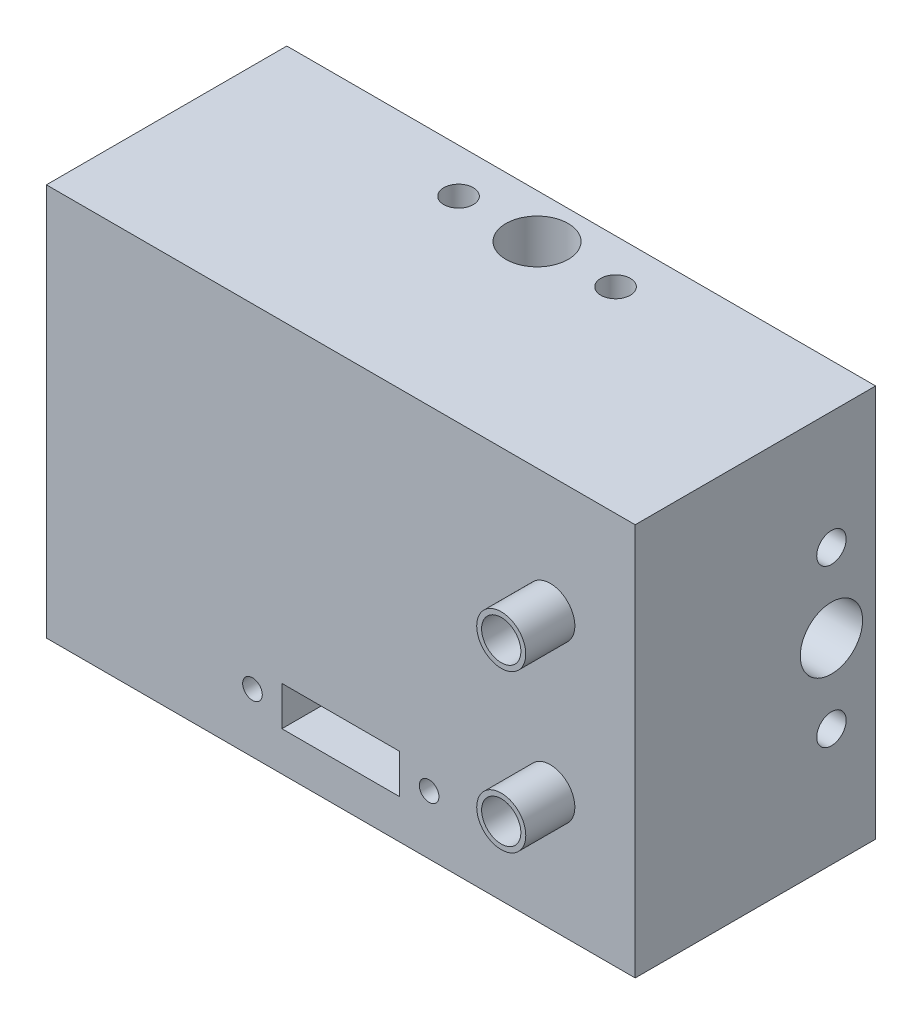
ISO-10303-21;
HEADER;
FILE_DESCRIPTION(('STEP AP214'),'2;1');
FILE_NAME('part.step','',(''),(''),'','','');
FILE_SCHEMA(('AUTOMOTIVE_DESIGN { 1 0 10303 214 1 1 1 1 }'));
ENDSEC;
DATA;
#1=APPLICATION_CONTEXT('core data for automotive mechanical design processes');
#2=APPLICATION_PROTOCOL_DEFINITION('international standard','automotive_design',2000,#1);
#3=PRODUCT_CONTEXT('',#1,'mechanical');
#4=PRODUCT('Part','Part','',(#3));
#5=PRODUCT_RELATED_PRODUCT_CATEGORY('part','',(#4));
#6=PRODUCT_DEFINITION_FORMATION('','',#4);
#7=PRODUCT_DEFINITION_CONTEXT('part definition',#1,'design');
#8=PRODUCT_DEFINITION('design','',#6,#7);
#9=PRODUCT_DEFINITION_SHAPE('','',#8);
#10=(LENGTH_UNIT() NAMED_UNIT(*) SI_UNIT(.MILLI.,.METRE.));
#11=(NAMED_UNIT(*) PLANE_ANGLE_UNIT() SI_UNIT($,.RADIAN.));
#12=(NAMED_UNIT(*) SI_UNIT($,.STERADIAN.) SOLID_ANGLE_UNIT());
#13=UNCERTAINTY_MEASURE_WITH_UNIT(LENGTH_MEASURE(1.E-05),#10,'distance_accuracy_value','');
#14=(GEOMETRIC_REPRESENTATION_CONTEXT(3) GLOBAL_UNCERTAINTY_ASSIGNED_CONTEXT((#13)) GLOBAL_UNIT_ASSIGNED_CONTEXT((#10,
#11,#12)) REPRESENTATION_CONTEXT('',''));
#15=CARTESIAN_POINT('',(0.,0.,0.));
#16=DIRECTION('',(0.,0.,1.));
#17=DIRECTION('',(1.,0.,0.));
#18=AXIS2_PLACEMENT_3D('',#15,#16,#17);
#19=CARTESIAN_POINT('',(0.,0.,24.5));
#20=DIRECTION('',(1.,0.,0.));
#21=DIRECTION('',(0.,0.,-1.));
#22=AXIS2_PLACEMENT_3D('',#19,#20,#21);
#23=PLANE('',#22);
#24=CARTESIAN_POINT('',(0.,12.,4.5));
#25=DIRECTION('',(-1.,0.,0.));
#26=DIRECTION('',(0.,0.,-1.));
#27=AXIS2_PLACEMENT_3D('',#24,#25,#26);
#28=CIRCLE('',#27,1.5);
#29=CARTESIAN_POINT('',(0.,12.,3.));
#30=VERTEX_POINT('',#29);
#31=EDGE_CURVE('E201',#30,#30,#28,.T.);
#32=ORIENTED_EDGE('',*,*,#31,.F.);
#33=EDGE_LOOP('',(#32));
#34=FACE_BOUND('',#33,.T.);
#35=CARTESIAN_POINT('',(0.,28.,4.5));
#36=DIRECTION('',(-1.,0.,0.));
#37=DIRECTION('',(0.,0.,1.));
#38=AXIS2_PLACEMENT_3D('',#35,#36,#37);
#39=CIRCLE('',#38,1.5);
#40=CARTESIAN_POINT('',(0.,28.,6.));
#41=VERTEX_POINT('',#40);
#42=EDGE_CURVE('E208',#41,#41,#39,.T.);
#43=ORIENTED_EDGE('',*,*,#42,.F.);
#44=EDGE_LOOP('',(#43));
#45=FACE_BOUND('',#44,.T.);
#46=CARTESIAN_POINT('',(0.,20.,4.5));
#47=DIRECTION('',(-1.,0.,0.));
#48=DIRECTION('',(0.,0.,1.));
#49=AXIS2_PLACEMENT_3D('',#46,#47,#48);
#50=CIRCLE('',#49,3.175);
#51=CARTESIAN_POINT('',(0.,20.,7.675));
#52=VERTEX_POINT('',#51);
#53=EDGE_CURVE('E207',#52,#52,#50,.T.);
#54=ORIENTED_EDGE('',*,*,#53,.F.);
#55=EDGE_LOOP('',(#54));
#56=FACE_BOUND('',#55,.T.);
#57=DIRECTION('',(0.,-1.,0.));
#58=VECTOR('',#57,1.);
#59=CARTESIAN_POINT('',(0.,0.,0.));
#60=LINE('',#59,#58);
#61=CARTESIAN_POINT('',(0.,40.,0.));
#62=VERTEX_POINT('',#61);
#63=CARTESIAN_POINT('',(0.,0.,0.));
#64=VERTEX_POINT('',#63);
#65=EDGE_CURVE('E228',#62,#64,#60,.T.);
#66=ORIENTED_EDGE('',*,*,#65,.T.);
#67=DIRECTION('',(0.,0.,-1.));
#68=VECTOR('',#67,1.);
#69=CARTESIAN_POINT('',(0.,0.,24.5));
#70=LINE('',#69,#68);
#71=CARTESIAN_POINT('',(0.,0.,24.5));
#72=VERTEX_POINT('',#71);
#73=EDGE_CURVE('E251',#72,#64,#70,.T.);
#74=ORIENTED_EDGE('',*,*,#73,.F.);
#75=DIRECTION('',(0.,-1.,0.));
#76=VECTOR('',#75,1.);
#77=CARTESIAN_POINT('',(0.,0.,24.5));
#78=LINE('',#77,#76);
#79=CARTESIAN_POINT('',(0.,40.,24.5));
#80=VERTEX_POINT('',#79);
#81=EDGE_CURVE('E231',#80,#72,#78,.T.);
#82=ORIENTED_EDGE('',*,*,#81,.F.);
#83=DIRECTION('',(0.,0.,-1.));
#84=VECTOR('',#83,1.);
#85=CARTESIAN_POINT('',(0.,40.,24.5));
#86=LINE('',#85,#84);
#87=EDGE_CURVE('E237',#80,#62,#86,.T.);
#88=ORIENTED_EDGE('',*,*,#87,.T.);
#89=EDGE_LOOP('',(#66,#74,#82,#88));
#90=FACE_BOUND('',#89,.T.);
#91=ADVANCED_FACE('F33',(#34,#45,#56,#90),#23,.F.);
#92=CARTESIAN_POINT('',(0.,0.,24.5));
#93=DIRECTION('',(0.,1.,0.));
#94=DIRECTION('',(0.,0.,1.));
#95=AXIS2_PLACEMENT_3D('',#92,#93,#94);
#96=PLANE('',#95);
#97=CARTESIAN_POINT('',(22.,0.,4.5));
#98=DIRECTION('',(0.,1.,0.));
#99=DIRECTION('',(0.,0.,-1.));
#100=AXIS2_PLACEMENT_3D('',#97,#98,#99);
#101=CIRCLE('',#100,1.5);
#102=CARTESIAN_POINT('',(22.,0.,3.));
#103=VERTEX_POINT('',#102);
#104=EDGE_CURVE('E146',#103,#103,#101,.T.);
#105=ORIENTED_EDGE('',*,*,#104,.T.);
#106=EDGE_LOOP('',(#105));
#107=FACE_BOUND('',#106,.T.);
#108=CARTESIAN_POINT('',(38.,0.,4.5));
#109=DIRECTION('',(0.,1.,0.));
#110=DIRECTION('',(0.,0.,1.));
#111=AXIS2_PLACEMENT_3D('',#108,#109,#110);
#112=CIRCLE('',#111,1.5);
#113=CARTESIAN_POINT('',(38.,0.,6.));
#114=VERTEX_POINT('',#113);
#115=EDGE_CURVE('E154',#114,#114,#112,.T.);
#116=ORIENTED_EDGE('',*,*,#115,.T.);
#117=EDGE_LOOP('',(#116));
#118=FACE_BOUND('',#117,.T.);
#119=CARTESIAN_POINT('',(30.,0.,4.5));
#120=DIRECTION('',(0.,1.,0.));
#121=DIRECTION('',(0.,0.,1.));
#122=AXIS2_PLACEMENT_3D('',#119,#120,#121);
#123=CIRCLE('',#122,3.175);
#124=CARTESIAN_POINT('',(30.,0.,7.675));
#125=VERTEX_POINT('',#124);
#126=EDGE_CURVE('E153',#125,#125,#123,.T.);
#127=ORIENTED_EDGE('',*,*,#126,.T.);
#128=EDGE_LOOP('',(#127));
#129=FACE_BOUND('',#128,.T.);
#130=DIRECTION('',(1.,0.,0.));
#131=VECTOR('',#130,1.);
#132=CARTESIAN_POINT('',(0.,0.,0.));
#133=LINE('',#132,#131);
#134=CARTESIAN_POINT('',(60.,0.,0.));
#135=VERTEX_POINT('',#134);
#136=EDGE_CURVE('E240',#64,#135,#133,.T.);
#137=ORIENTED_EDGE('',*,*,#136,.T.);
#138=DIRECTION('',(0.,0.,-1.));
#139=VECTOR('',#138,1.);
#140=CARTESIAN_POINT('',(60.,0.,24.5));
#141=LINE('',#140,#139);
#142=CARTESIAN_POINT('',(60.,0.,24.5));
#143=VERTEX_POINT('',#142);
#144=EDGE_CURVE('E248',#143,#135,#141,.T.);
#145=ORIENTED_EDGE('',*,*,#144,.F.);
#146=DIRECTION('',(1.,0.,0.));
#147=VECTOR('',#146,1.);
#148=CARTESIAN_POINT('',(0.,0.,24.5));
#149=LINE('',#148,#147);
#150=EDGE_CURVE('E85',#72,#143,#149,.T.);
#151=ORIENTED_EDGE('',*,*,#150,.F.);
#152=ORIENTED_EDGE('',*,*,#73,.T.);
#153=EDGE_LOOP('',(#137,#145,#151,#152));
#154=FACE_BOUND('',#153,.T.);
#155=ADVANCED_FACE('F281',(#107,#118,#129,#154),#96,.F.);
#156=CARTESIAN_POINT('',(60.,0.,24.5));
#157=DIRECTION('',(-1.,0.,0.));
#158=DIRECTION('',(0.,0.,1.));
#159=AXIS2_PLACEMENT_3D('',#156,#157,#158);
#160=PLANE('',#159);
#161=CARTESIAN_POINT('',(60.,12.,4.5));
#162=DIRECTION('',(-1.,0.,0.));
#163=DIRECTION('',(0.,0.,-1.));
#164=AXIS2_PLACEMENT_3D('',#161,#162,#163);
#165=CIRCLE('',#164,1.5);
#166=CARTESIAN_POINT('',(60.,12.,3.));
#167=VERTEX_POINT('',#166);
#168=EDGE_CURVE('E183',#167,#167,#165,.T.);
#169=ORIENTED_EDGE('',*,*,#168,.T.);
#170=EDGE_LOOP('',(#169));
#171=FACE_BOUND('',#170,.T.);
#172=CARTESIAN_POINT('',(60.,28.,4.5));
#173=DIRECTION('',(-1.,0.,0.));
#174=DIRECTION('',(0.,0.,1.));
#175=AXIS2_PLACEMENT_3D('',#172,#173,#174);
#176=CIRCLE('',#175,1.5);
#177=CARTESIAN_POINT('',(60.,28.,6.));
#178=VERTEX_POINT('',#177);
#179=EDGE_CURVE('E190',#178,#178,#176,.T.);
#180=ORIENTED_EDGE('',*,*,#179,.T.);
#181=EDGE_LOOP('',(#180));
#182=FACE_BOUND('',#181,.T.);
#183=CARTESIAN_POINT('',(60.,20.,4.5));
#184=DIRECTION('',(-1.,0.,0.));
#185=DIRECTION('',(0.,0.,1.));
#186=AXIS2_PLACEMENT_3D('',#183,#184,#185);
#187=CIRCLE('',#186,3.175);
#188=CARTESIAN_POINT('',(60.,20.,7.675));
#189=VERTEX_POINT('',#188);
#190=EDGE_CURVE('E189',#189,#189,#187,.T.);
#191=ORIENTED_EDGE('',*,*,#190,.T.);
#192=EDGE_LOOP('',(#191));
#193=FACE_BOUND('',#192,.T.);
#194=DIRECTION('',(0.,1.,0.));
#195=VECTOR('',#194,1.);
#196=CARTESIAN_POINT('',(60.,0.,0.));
#197=LINE('',#196,#195);
#198=CARTESIAN_POINT('',(60.,40.,0.));
#199=VERTEX_POINT('',#198);
#200=EDGE_CURVE('E242',#135,#199,#197,.T.);
#201=ORIENTED_EDGE('',*,*,#200,.T.);
#202=DIRECTION('',(0.,0.,-1.));
#203=VECTOR('',#202,1.);
#204=CARTESIAN_POINT('',(60.,40.,24.5));
#205=LINE('',#204,#203);
#206=CARTESIAN_POINT('',(60.,40.,24.5));
#207=VERTEX_POINT('',#206);
#208=EDGE_CURVE('E246',#207,#199,#205,.T.);
#209=ORIENTED_EDGE('',*,*,#208,.F.);
#210=DIRECTION('',(0.,1.,0.));
#211=VECTOR('',#210,1.);
#212=CARTESIAN_POINT('',(60.,0.,24.5));
#213=LINE('',#212,#211);
#214=EDGE_CURVE('E234',#143,#207,#213,.T.);
#215=ORIENTED_EDGE('',*,*,#214,.F.);
#216=ORIENTED_EDGE('',*,*,#144,.T.);
#217=EDGE_LOOP('',(#201,#209,#215,#216));
#218=FACE_BOUND('',#217,.T.);
#219=ADVANCED_FACE('F286',(#171,#182,#193,#218),#160,.F.);
#220=CARTESIAN_POINT('',(0.,40.,24.5));
#221=DIRECTION('',(0.,-1.,0.));
#222=DIRECTION('',(0.,0.,-1.));
#223=AXIS2_PLACEMENT_3D('',#220,#221,#222);
#224=PLANE('',#223);
#225=CARTESIAN_POINT('',(22.,40.,4.5));
#226=DIRECTION('',(0.,1.,0.));
#227=DIRECTION('',(0.,0.,-1.));
#228=AXIS2_PLACEMENT_3D('',#225,#226,#227);
#229=CIRCLE('',#228,1.5);
#230=CARTESIAN_POINT('',(22.,40.,3.));
#231=VERTEX_POINT('',#230);
#232=EDGE_CURVE('E165',#231,#231,#229,.T.);
#233=ORIENTED_EDGE('',*,*,#232,.F.);
#234=EDGE_LOOP('',(#233));
#235=FACE_BOUND('',#234,.T.);
#236=CARTESIAN_POINT('',(38.,40.,4.5));
#237=DIRECTION('',(0.,1.,0.));
#238=DIRECTION('',(0.,0.,1.));
#239=AXIS2_PLACEMENT_3D('',#236,#237,#238);
#240=CIRCLE('',#239,1.5);
#241=CARTESIAN_POINT('',(38.,40.,6.));
#242=VERTEX_POINT('',#241);
#243=EDGE_CURVE('E172',#242,#242,#240,.T.);
#244=ORIENTED_EDGE('',*,*,#243,.F.);
#245=EDGE_LOOP('',(#244));
#246=FACE_BOUND('',#245,.T.);
#247=CARTESIAN_POINT('',(30.,40.,4.5));
#248=DIRECTION('',(0.,1.,0.));
#249=DIRECTION('',(0.,0.,1.));
#250=AXIS2_PLACEMENT_3D('',#247,#248,#249);
#251=CIRCLE('',#250,3.175);
#252=CARTESIAN_POINT('',(30.,40.,7.675));
#253=VERTEX_POINT('',#252);
#254=EDGE_CURVE('E171',#253,#253,#251,.T.);
#255=ORIENTED_EDGE('',*,*,#254,.F.);
#256=EDGE_LOOP('',(#255));
#257=FACE_BOUND('',#256,.T.);
#258=DIRECTION('',(-1.,0.,0.));
#259=VECTOR('',#258,1.);
#260=CARTESIAN_POINT('',(0.,40.,0.));
#261=LINE('',#260,#259);
#262=EDGE_CURVE('E77',#199,#62,#261,.T.);
#263=ORIENTED_EDGE('',*,*,#262,.T.);
#264=ORIENTED_EDGE('',*,*,#87,.F.);
#265=DIRECTION('',(-1.,0.,0.));
#266=VECTOR('',#265,1.);
#267=CARTESIAN_POINT('',(0.,40.,24.5));
#268=LINE('',#267,#266);
#269=EDGE_CURVE('E56',#207,#80,#268,.T.);
#270=ORIENTED_EDGE('',*,*,#269,.F.);
#271=ORIENTED_EDGE('',*,*,#208,.T.);
#272=EDGE_LOOP('',(#263,#264,#270,#271));
#273=FACE_BOUND('',#272,.T.);
#274=ADVANCED_FACE('F264',(#235,#246,#257,#273),#224,.F.);
#275=CARTESIAN_POINT('',(0.,0.,24.5));
#276=DIRECTION('',(0.,0.,-1.));
#277=DIRECTION('',(-1.,0.,0.));
#278=AXIS2_PLACEMENT_3D('',#275,#276,#277);
#279=PLANE('',#278);
#280=CARTESIAN_POINT('',(51.35,28.,24.5));
#281=DIRECTION('',(0.,0.,-1.));
#282=DIRECTION('',(-1.,0.,0.));
#283=AXIS2_PLACEMENT_3D('',#280,#281,#282);
#284=CIRCLE('',#283,2.5);
#285=CARTESIAN_POINT('',(48.85,28.,24.5));
#286=VERTEX_POINT('',#285);
#287=EDGE_CURVE('E11',#286,#286,#284,.F.);
#288=ORIENTED_EDGE('',*,*,#287,.F.);
#289=EDGE_LOOP('',(#288));
#290=FACE_BOUND('',#289,.T.);
#291=CARTESIAN_POINT('',(51.35,12.,24.5));
#292=DIRECTION('',(0.,0.,-1.));
#293=DIRECTION('',(-1.,0.,0.));
#294=AXIS2_PLACEMENT_3D('',#291,#292,#293);
#295=CIRCLE('',#294,2.5);
#296=CARTESIAN_POINT('',(48.85,12.,24.5));
#297=VERTEX_POINT('',#296);
#298=EDGE_CURVE('E40',#297,#297,#295,.F.);
#299=ORIENTED_EDGE('',*,*,#298,.F.);
#300=EDGE_LOOP('',(#299));
#301=FACE_BOUND('',#300,.T.);
#302=CARTESIAN_POINT('',(39.,6.,24.5));
#303=DIRECTION('',(0.,0.,1.));
#304=DIRECTION('',(-1.,0.,0.));
#305=AXIS2_PLACEMENT_3D('',#302,#303,#304);
#306=CIRCLE('',#305,1.);
#307=CARTESIAN_POINT('',(38.,6.,24.5));
#308=VERTEX_POINT('',#307);
#309=EDGE_CURVE('E133',#308,#308,#306,.T.);
#310=ORIENTED_EDGE('',*,*,#309,.F.);
#311=EDGE_LOOP('',(#310));
#312=FACE_BOUND('',#311,.T.);
#313=CARTESIAN_POINT('',(21.,6.,24.5));
#314=DIRECTION('',(0.,0.,1.));
#315=DIRECTION('',(1.,0.,0.));
#316=AXIS2_PLACEMENT_3D('',#313,#314,#315);
#317=CIRCLE('',#316,1.);
#318=CARTESIAN_POINT('',(22.,6.,24.5));
#319=VERTEX_POINT('',#318);
#320=EDGE_CURVE('E275',#319,#319,#317,.T.);
#321=ORIENTED_EDGE('',*,*,#320,.F.);
#322=EDGE_LOOP('',(#321));
#323=FACE_BOUND('',#322,.T.);
#324=DIRECTION('',(-1.,0.,0.));
#325=VECTOR('',#324,1.);
#326=CARTESIAN_POINT('',(24.,8.,24.5));
#327=LINE('',#326,#325);
#328=CARTESIAN_POINT('',(36.,8.,24.5));
#329=VERTEX_POINT('',#328);
#330=CARTESIAN_POINT('',(24.,8.,24.5));
#331=VERTEX_POINT('',#330);
#332=EDGE_CURVE('E139',#329,#331,#327,.T.);
#333=ORIENTED_EDGE('',*,*,#332,.F.);
#334=DIRECTION('',(0.,1.,0.));
#335=VECTOR('',#334,1.);
#336=CARTESIAN_POINT('',(36.,4.,24.5));
#337=LINE('',#336,#335);
#338=CARTESIAN_POINT('',(36.,4.,24.5));
#339=VERTEX_POINT('',#338);
#340=EDGE_CURVE('E47',#339,#329,#337,.T.);
#341=ORIENTED_EDGE('',*,*,#340,.F.);
#342=DIRECTION('',(1.,0.,0.));
#343=VECTOR('',#342,1.);
#344=CARTESIAN_POINT('',(24.,4.,24.5));
#345=LINE('',#344,#343);
#346=CARTESIAN_POINT('',(24.,4.,24.5));
#347=VERTEX_POINT('',#346);
#348=EDGE_CURVE('E127',#347,#339,#345,.T.);
#349=ORIENTED_EDGE('',*,*,#348,.F.);
#350=DIRECTION('',(0.,-1.,0.));
#351=VECTOR('',#350,1.);
#352=CARTESIAN_POINT('',(24.,4.,24.5));
#353=LINE('',#352,#351);
#354=EDGE_CURVE('E130',#331,#347,#353,.T.);
#355=ORIENTED_EDGE('',*,*,#354,.F.);
#356=EDGE_LOOP('',(#333,#341,#349,#355));
#357=FACE_BOUND('',#356,.T.);
#358=ORIENTED_EDGE('',*,*,#81,.T.);
#359=ORIENTED_EDGE('',*,*,#150,.T.);
#360=ORIENTED_EDGE('',*,*,#214,.T.);
#361=ORIENTED_EDGE('',*,*,#269,.T.);
#362=EDGE_LOOP('',(#358,#359,#360,#361));
#363=FACE_BOUND('',#362,.T.);
#364=ADVANCED_FACE('F260',(#290,#301,#312,#323,#357,#363),#279,.F.);
#365=CARTESIAN_POINT('',(0.,0.,0.));
#366=DIRECTION('',(0.,0.,-1.));
#367=DIRECTION('',(-1.,0.,0.));
#368=AXIS2_PLACEMENT_3D('',#365,#366,#367);
#369=PLANE('',#368);
#370=CARTESIAN_POINT('',(30.,20.,0.));
#371=DIRECTION('',(0.,0.,-1.));
#372=DIRECTION('',(-1.,0.,0.));
#373=AXIS2_PLACEMENT_3D('',#370,#371,#372);
#374=CIRCLE('',#373,15.);
#375=CARTESIAN_POINT('',(15.,20.,0.));
#376=VERTEX_POINT('',#375);
#377=EDGE_CURVE('E224',#376,#376,#374,.T.);
#378=ORIENTED_EDGE('',*,*,#377,.F.);
#379=EDGE_LOOP('',(#378));
#380=FACE_BOUND('',#379,.T.);
#381=ORIENTED_EDGE('',*,*,#65,.F.);
#382=ORIENTED_EDGE('',*,*,#262,.F.);
#383=ORIENTED_EDGE('',*,*,#200,.F.);
#384=ORIENTED_EDGE('',*,*,#136,.F.);
#385=EDGE_LOOP('',(#381,#382,#383,#384));
#386=FACE_BOUND('',#385,.T.);
#387=ADVANCED_FACE('F263',(#380,#386),#369,.T.);
#388=CARTESIAN_POINT('',(30.,20.,-1.));
#389=DIRECTION('',(0.,0.,-1.));
#390=DIRECTION('',(-1.,0.,0.));
#391=AXIS2_PLACEMENT_3D('',#388,#389,#390);
#392=PLANE('',#391);
#393=CARTESIAN_POINT('',(30.,20.,-1.));
#394=DIRECTION('',(0.,0.,-1.));
#395=DIRECTION('',(-1.,0.,0.));
#396=AXIS2_PLACEMENT_3D('',#393,#394,#395);
#397=CIRCLE('',#396,15.);
#398=CARTESIAN_POINT('',(15.,20.,-1.));
#399=VERTEX_POINT('',#398);
#400=EDGE_CURVE('E225',#399,#399,#397,.T.);
#401=ORIENTED_EDGE('',*,*,#400,.T.);
#402=EDGE_LOOP('',(#401));
#403=FACE_BOUND('',#402,.T.);
#404=CARTESIAN_POINT('',(30.,20.,-1.));
#405=DIRECTION('',(0.,0.,-1.));
#406=DIRECTION('',(-1.,0.,0.));
#407=AXIS2_PLACEMENT_3D('',#404,#405,#406);
#408=CIRCLE('',#407,14.);
#409=CARTESIAN_POINT('',(16.,20.,-1.));
#410=VERTEX_POINT('',#409);
#411=EDGE_CURVE('E219',#410,#410,#408,.T.);
#412=ORIENTED_EDGE('',*,*,#411,.F.);
#413=EDGE_LOOP('',(#412));
#414=FACE_BOUND('',#413,.T.);
#415=ADVANCED_FACE('F289',(#403,#414),#392,.T.);
#416=CARTESIAN_POINT('',(30.,20.,-1.));
#417=DIRECTION('',(0.,0.,1.));
#418=DIRECTION('',(1.,0.,0.));
#419=AXIS2_PLACEMENT_3D('',#416,#417,#418);
#420=CYLINDRICAL_SURFACE('',#419,15.);
#421=ORIENTED_EDGE('',*,*,#400,.F.);
#422=EDGE_LOOP('',(#421));
#423=FACE_BOUND('',#422,.T.);
#424=ORIENTED_EDGE('',*,*,#377,.T.);
#425=EDGE_LOOP('',(#424));
#426=FACE_BOUND('',#425,.T.);
#427=ADVANCED_FACE('F296',(#423,#426),#420,.T.);
#428=CARTESIAN_POINT('',(30.,20.,-1.));
#429=DIRECTION('',(0.,0.,1.));
#430=DIRECTION('',(1.,0.,0.));
#431=AXIS2_PLACEMENT_3D('',#428,#429,#430);
#432=CYLINDRICAL_SURFACE('',#431,14.);
#433=ORIENTED_EDGE('',*,*,#411,.T.);
#434=EDGE_LOOP('',(#433));
#435=FACE_BOUND('',#434,.T.);
#436=CARTESIAN_POINT('',(30.,20.,0.));
#437=DIRECTION('',(0.,0.,-1.));
#438=DIRECTION('',(-1.,0.,0.));
#439=AXIS2_PLACEMENT_3D('',#436,#437,#438);
#440=CIRCLE('',#439,14.);
#441=CARTESIAN_POINT('',(16.,20.,0.));
#442=VERTEX_POINT('',#441);
#443=EDGE_CURVE('E253',#442,#442,#440,.F.);
#444=ORIENTED_EDGE('',*,*,#443,.T.);
#445=EDGE_LOOP('',(#444));
#446=FACE_BOUND('',#445,.T.);
#447=ADVANCED_FACE('F303',(#435,#446),#432,.F.);
#448=ORIENTED_EDGE('',*,*,#443,.F.);
#449=EDGE_LOOP('',(#448));
#450=FACE_BOUND('',#449,.T.);
#451=ADVANCED_FACE('F292',(#450),#369,.T.);
#452=CARTESIAN_POINT('',(10.,20.,4.5));
#453=DIRECTION('',(-1.,0.,0.));
#454=DIRECTION('',(0.,0.,1.));
#455=AXIS2_PLACEMENT_3D('',#452,#453,#454);
#456=CYLINDRICAL_SURFACE('',#455,3.175);
#457=CARTESIAN_POINT('',(10.,20.,4.5));
#458=DIRECTION('',(-1.,0.,0.));
#459=DIRECTION('',(0.,0.,1.));
#460=AXIS2_PLACEMENT_3D('',#457,#458,#459);
#461=CIRCLE('',#460,3.175);
#462=CARTESIAN_POINT('',(10.,20.,7.675));
#463=VERTEX_POINT('',#462);
#464=EDGE_CURVE('E216',#463,#463,#461,.T.);
#465=ORIENTED_EDGE('',*,*,#464,.F.);
#466=EDGE_LOOP('',(#465));
#467=FACE_BOUND('',#466,.T.);
#468=ORIENTED_EDGE('',*,*,#53,.T.);
#469=EDGE_LOOP('',(#468));
#470=FACE_BOUND('',#469,.T.);
#471=ADVANCED_FACE('F302',(#467,#470),#456,.F.);
#472=CARTESIAN_POINT('',(10.,20.,4.5));
#473=DIRECTION('',(-1.,0.,0.));
#474=DIRECTION('',(0.,0.,1.));
#475=AXIS2_PLACEMENT_3D('',#472,#473,#474);
#476=PLANE('',#475);
#477=ORIENTED_EDGE('',*,*,#464,.T.);
#478=EDGE_LOOP('',(#477));
#479=FACE_BOUND('',#478,.T.);
#480=ADVANCED_FACE('F318',(#479),#476,.T.);
#481=CARTESIAN_POINT('',(10.,28.,4.5));
#482=DIRECTION('',(-1.,0.,0.));
#483=DIRECTION('',(0.,0.,1.));
#484=AXIS2_PLACEMENT_3D('',#481,#482,#483);
#485=CYLINDRICAL_SURFACE('',#484,1.5);
#486=CARTESIAN_POINT('',(10.,28.,4.5));
#487=DIRECTION('',(-1.,0.,0.));
#488=DIRECTION('',(0.,0.,1.));
#489=AXIS2_PLACEMENT_3D('',#486,#487,#488);
#490=CIRCLE('',#489,1.5);
#491=CARTESIAN_POINT('',(10.,28.,6.));
#492=VERTEX_POINT('',#491);
#493=EDGE_CURVE('E204',#492,#492,#490,.T.);
#494=ORIENTED_EDGE('',*,*,#493,.F.);
#495=EDGE_LOOP('',(#494));
#496=FACE_BOUND('',#495,.T.);
#497=ORIENTED_EDGE('',*,*,#42,.T.);
#498=EDGE_LOOP('',(#497));
#499=FACE_BOUND('',#498,.T.);
#500=ADVANCED_FACE('F324',(#496,#499),#485,.F.);
#501=CARTESIAN_POINT('',(10.,28.,4.5));
#502=DIRECTION('',(-1.,0.,0.));
#503=DIRECTION('',(0.,0.,1.));
#504=AXIS2_PLACEMENT_3D('',#501,#502,#503);
#505=PLANE('',#504);
#506=ORIENTED_EDGE('',*,*,#493,.T.);
#507=EDGE_LOOP('',(#506));
#508=FACE_BOUND('',#507,.T.);
#509=ADVANCED_FACE('F379',(#508),#505,.T.);
#510=CARTESIAN_POINT('',(10.,12.,4.5));
#511=DIRECTION('',(-1.,0.,0.));
#512=DIRECTION('',(0.,0.,1.));
#513=AXIS2_PLACEMENT_3D('',#510,#511,#512);
#514=CYLINDRICAL_SURFACE('',#513,1.5);
#515=CARTESIAN_POINT('',(10.,12.,4.5));
#516=DIRECTION('',(-1.,0.,0.));
#517=DIRECTION('',(0.,0.,-1.));
#518=AXIS2_PLACEMENT_3D('',#515,#516,#517);
#519=CIRCLE('',#518,1.5);
#520=CARTESIAN_POINT('',(10.,12.,3.));
#521=VERTEX_POINT('',#520);
#522=EDGE_CURVE('E211',#521,#521,#519,.T.);
#523=ORIENTED_EDGE('',*,*,#522,.F.);
#524=EDGE_LOOP('',(#523));
#525=FACE_BOUND('',#524,.T.);
#526=ORIENTED_EDGE('',*,*,#31,.T.);
#527=EDGE_LOOP('',(#526));
#528=FACE_BOUND('',#527,.T.);
#529=ADVANCED_FACE('F389',(#525,#528),#514,.F.);
#530=CARTESIAN_POINT('',(10.,12.,4.5));
#531=DIRECTION('',(1.,0.,0.));
#532=DIRECTION('',(0.,0.,-1.));
#533=AXIS2_PLACEMENT_3D('',#530,#531,#532);
#534=PLANE('',#533);
#535=ORIENTED_EDGE('',*,*,#522,.T.);
#536=EDGE_LOOP('',(#535));
#537=FACE_BOUND('',#536,.T.);
#538=ADVANCED_FACE('F399',(#537),#534,.F.);
#539=CARTESIAN_POINT('',(50.,20.,4.5));
#540=DIRECTION('',(1.,0.,0.));
#541=DIRECTION('',(0.,0.,-1.));
#542=AXIS2_PLACEMENT_3D('',#539,#540,#541);
#543=CYLINDRICAL_SURFACE('',#542,3.175);
#544=CARTESIAN_POINT('',(50.,20.,4.5));
#545=DIRECTION('',(-1.,0.,0.));
#546=DIRECTION('',(0.,0.,1.));
#547=AXIS2_PLACEMENT_3D('',#544,#545,#546);
#548=CIRCLE('',#547,3.175);
#549=CARTESIAN_POINT('',(50.,20.,7.675));
#550=VERTEX_POINT('',#549);
#551=EDGE_CURVE('E198',#550,#550,#548,.T.);
#552=ORIENTED_EDGE('',*,*,#551,.T.);
#553=EDGE_LOOP('',(#552));
#554=FACE_BOUND('',#553,.T.);
#555=ORIENTED_EDGE('',*,*,#190,.F.);
#556=EDGE_LOOP('',(#555));
#557=FACE_BOUND('',#556,.T.);
#558=ADVANCED_FACE('F408',(#554,#557),#543,.F.);
#559=CARTESIAN_POINT('',(50.,20.,4.5));
#560=DIRECTION('',(1.,0.,0.));
#561=DIRECTION('',(0.,0.,1.));
#562=AXIS2_PLACEMENT_3D('',#559,#560,#561);
#563=PLANE('',#562);
#564=ORIENTED_EDGE('',*,*,#551,.F.);
#565=EDGE_LOOP('',(#564));
#566=FACE_BOUND('',#565,.T.);
#567=ADVANCED_FACE('F429',(#566),#563,.T.);
#568=CARTESIAN_POINT('',(50.,28.,4.5));
#569=DIRECTION('',(1.,0.,0.));
#570=DIRECTION('',(0.,0.,-1.));
#571=AXIS2_PLACEMENT_3D('',#568,#569,#570);
#572=CYLINDRICAL_SURFACE('',#571,1.5);
#573=CARTESIAN_POINT('',(50.,28.,4.5));
#574=DIRECTION('',(-1.,0.,0.));
#575=DIRECTION('',(0.,0.,1.));
#576=AXIS2_PLACEMENT_3D('',#573,#574,#575);
#577=CIRCLE('',#576,1.5);
#578=CARTESIAN_POINT('',(50.,28.,6.));
#579=VERTEX_POINT('',#578);
#580=EDGE_CURVE('E186',#579,#579,#577,.T.);
#581=ORIENTED_EDGE('',*,*,#580,.T.);
#582=EDGE_LOOP('',(#581));
#583=FACE_BOUND('',#582,.T.);
#584=ORIENTED_EDGE('',*,*,#179,.F.);
#585=EDGE_LOOP('',(#584));
#586=FACE_BOUND('',#585,.T.);
#587=ADVANCED_FACE('F439',(#583,#586),#572,.F.);
#588=CARTESIAN_POINT('',(50.,28.,4.5));
#589=DIRECTION('',(1.,0.,0.));
#590=DIRECTION('',(0.,0.,1.));
#591=AXIS2_PLACEMENT_3D('',#588,#589,#590);
#592=PLANE('',#591);
#593=ORIENTED_EDGE('',*,*,#580,.F.);
#594=EDGE_LOOP('',(#593));
#595=FACE_BOUND('',#594,.T.);
#596=ADVANCED_FACE('F449',(#595),#592,.T.);
#597=CARTESIAN_POINT('',(50.,12.,4.5));
#598=DIRECTION('',(1.,0.,0.));
#599=DIRECTION('',(0.,0.,-1.));
#600=AXIS2_PLACEMENT_3D('',#597,#598,#599);
#601=CYLINDRICAL_SURFACE('',#600,1.5);
#602=CARTESIAN_POINT('',(50.,12.,4.5));
#603=DIRECTION('',(-1.,0.,0.));
#604=DIRECTION('',(0.,0.,-1.));
#605=AXIS2_PLACEMENT_3D('',#602,#603,#604);
#606=CIRCLE('',#605,1.5);
#607=CARTESIAN_POINT('',(50.,12.,3.));
#608=VERTEX_POINT('',#607);
#609=EDGE_CURVE('E193',#608,#608,#606,.T.);
#610=ORIENTED_EDGE('',*,*,#609,.T.);
#611=EDGE_LOOP('',(#610));
#612=FACE_BOUND('',#611,.T.);
#613=ORIENTED_EDGE('',*,*,#168,.F.);
#614=EDGE_LOOP('',(#613));
#615=FACE_BOUND('',#614,.T.);
#616=ADVANCED_FACE('F459',(#612,#615),#601,.F.);
#617=CARTESIAN_POINT('',(50.,12.,4.5));
#618=DIRECTION('',(-1.,0.,0.));
#619=DIRECTION('',(0.,0.,-1.));
#620=AXIS2_PLACEMENT_3D('',#617,#618,#619);
#621=PLANE('',#620);
#622=ORIENTED_EDGE('',*,*,#609,.F.);
#623=EDGE_LOOP('',(#622));
#624=FACE_BOUND('',#623,.T.);
#625=ADVANCED_FACE('F469',(#624),#621,.F.);
#626=CARTESIAN_POINT('',(30.,30.,4.5));
#627=DIRECTION('',(0.,1.,0.));
#628=DIRECTION('',(0.,0.,1.));
#629=AXIS2_PLACEMENT_3D('',#626,#627,#628);
#630=CYLINDRICAL_SURFACE('',#629,3.175);
#631=CARTESIAN_POINT('',(30.,30.,4.5));
#632=DIRECTION('',(0.,1.,0.));
#633=DIRECTION('',(0.,0.,1.));
#634=AXIS2_PLACEMENT_3D('',#631,#632,#633);
#635=CIRCLE('',#634,3.175);
#636=CARTESIAN_POINT('',(30.,30.,7.675));
#637=VERTEX_POINT('',#636);
#638=EDGE_CURVE('E180',#637,#637,#635,.T.);
#639=ORIENTED_EDGE('',*,*,#638,.F.);
#640=EDGE_LOOP('',(#639));
#641=FACE_BOUND('',#640,.T.);
#642=ORIENTED_EDGE('',*,*,#254,.T.);
#643=EDGE_LOOP('',(#642));
#644=FACE_BOUND('',#643,.T.);
#645=ADVANCED_FACE('F479',(#641,#644),#630,.F.);
#646=CARTESIAN_POINT('',(30.,30.,4.5));
#647=DIRECTION('',(0.,1.,0.));
#648=DIRECTION('',(0.,0.,1.));
#649=AXIS2_PLACEMENT_3D('',#646,#647,#648);
#650=PLANE('',#649);
#651=ORIENTED_EDGE('',*,*,#638,.T.);
#652=EDGE_LOOP('',(#651));
#653=FACE_BOUND('',#652,.T.);
#654=ADVANCED_FACE('F496',(#653),#650,.T.);
#655=CARTESIAN_POINT('',(38.,30.,4.5));
#656=DIRECTION('',(0.,1.,0.));
#657=DIRECTION('',(0.,0.,1.));
#658=AXIS2_PLACEMENT_3D('',#655,#656,#657);
#659=CYLINDRICAL_SURFACE('',#658,1.5);
#660=CARTESIAN_POINT('',(38.,30.,4.5));
#661=DIRECTION('',(0.,1.,0.));
#662=DIRECTION('',(0.,0.,1.));
#663=AXIS2_PLACEMENT_3D('',#660,#661,#662);
#664=CIRCLE('',#663,1.5);
#665=CARTESIAN_POINT('',(38.,30.,6.));
#666=VERTEX_POINT('',#665);
#667=EDGE_CURVE('E168',#666,#666,#664,.T.);
#668=ORIENTED_EDGE('',*,*,#667,.F.);
#669=EDGE_LOOP('',(#668));
#670=FACE_BOUND('',#669,.T.);
#671=ORIENTED_EDGE('',*,*,#243,.T.);
#672=EDGE_LOOP('',(#671));
#673=FACE_BOUND('',#672,.T.);
#674=ADVANCED_FACE('F506',(#670,#673),#659,.F.);
#675=CARTESIAN_POINT('',(38.,30.,4.5));
#676=DIRECTION('',(0.,1.,0.));
#677=DIRECTION('',(0.,0.,1.));
#678=AXIS2_PLACEMENT_3D('',#675,#676,#677);
#679=PLANE('',#678);
#680=ORIENTED_EDGE('',*,*,#667,.T.);
#681=EDGE_LOOP('',(#680));
#682=FACE_BOUND('',#681,.T.);
#683=ADVANCED_FACE('F516',(#682),#679,.T.);
#684=CARTESIAN_POINT('',(22.,30.,4.5));
#685=DIRECTION('',(0.,1.,0.));
#686=DIRECTION('',(0.,0.,1.));
#687=AXIS2_PLACEMENT_3D('',#684,#685,#686);
#688=CYLINDRICAL_SURFACE('',#687,1.5);
#689=CARTESIAN_POINT('',(22.,30.,4.5));
#690=DIRECTION('',(0.,1.,0.));
#691=DIRECTION('',(0.,0.,-1.));
#692=AXIS2_PLACEMENT_3D('',#689,#690,#691);
#693=CIRCLE('',#692,1.5);
#694=CARTESIAN_POINT('',(22.,30.,3.));
#695=VERTEX_POINT('',#694);
#696=EDGE_CURVE('E175',#695,#695,#693,.T.);
#697=ORIENTED_EDGE('',*,*,#696,.F.);
#698=EDGE_LOOP('',(#697));
#699=FACE_BOUND('',#698,.T.);
#700=ORIENTED_EDGE('',*,*,#232,.T.);
#701=EDGE_LOOP('',(#700));
#702=FACE_BOUND('',#701,.T.);
#703=ADVANCED_FACE('F526',(#699,#702),#688,.F.);
#704=CARTESIAN_POINT('',(22.,30.,4.5));
#705=DIRECTION('',(0.,-1.,0.));
#706=DIRECTION('',(0.,0.,-1.));
#707=AXIS2_PLACEMENT_3D('',#704,#705,#706);
#708=PLANE('',#707);
#709=ORIENTED_EDGE('',*,*,#696,.T.);
#710=EDGE_LOOP('',(#709));
#711=FACE_BOUND('',#710,.T.);
#712=ADVANCED_FACE('F536',(#711),#708,.F.);
#713=CARTESIAN_POINT('',(30.,10.,4.5));
#714=DIRECTION('',(0.,-1.,0.));
#715=DIRECTION('',(0.,0.,-1.));
#716=AXIS2_PLACEMENT_3D('',#713,#714,#715);
#717=CYLINDRICAL_SURFACE('',#716,3.175);
#718=CARTESIAN_POINT('',(30.,10.,4.5));
#719=DIRECTION('',(0.,1.,0.));
#720=DIRECTION('',(0.,0.,1.));
#721=AXIS2_PLACEMENT_3D('',#718,#719,#720);
#722=CIRCLE('',#721,3.175);
#723=CARTESIAN_POINT('',(30.,10.,7.675));
#724=VERTEX_POINT('',#723);
#725=EDGE_CURVE('E162',#724,#724,#722,.T.);
#726=ORIENTED_EDGE('',*,*,#725,.T.);
#727=EDGE_LOOP('',(#726));
#728=FACE_BOUND('',#727,.T.);
#729=ORIENTED_EDGE('',*,*,#126,.F.);
#730=EDGE_LOOP('',(#729));
#731=FACE_BOUND('',#730,.T.);
#732=ADVANCED_FACE('F546',(#728,#731),#717,.F.);
#733=CARTESIAN_POINT('',(30.,10.,4.5));
#734=DIRECTION('',(0.,-1.,0.));
#735=DIRECTION('',(0.,0.,1.));
#736=AXIS2_PLACEMENT_3D('',#733,#734,#735);
#737=PLANE('',#736);
#738=ORIENTED_EDGE('',*,*,#725,.F.);
#739=EDGE_LOOP('',(#738));
#740=FACE_BOUND('',#739,.T.);
#741=ADVANCED_FACE('F561',(#740),#737,.T.);
#742=CARTESIAN_POINT('',(38.,10.,4.5));
#743=DIRECTION('',(0.,-1.,0.));
#744=DIRECTION('',(0.,0.,-1.));
#745=AXIS2_PLACEMENT_3D('',#742,#743,#744);
#746=CYLINDRICAL_SURFACE('',#745,1.5);
#747=CARTESIAN_POINT('',(38.,10.,4.5));
#748=DIRECTION('',(0.,1.,0.));
#749=DIRECTION('',(0.,0.,1.));
#750=AXIS2_PLACEMENT_3D('',#747,#748,#749);
#751=CIRCLE('',#750,1.5);
#752=CARTESIAN_POINT('',(38.,10.,6.));
#753=VERTEX_POINT('',#752);
#754=EDGE_CURVE('E150',#753,#753,#751,.T.);
#755=ORIENTED_EDGE('',*,*,#754,.T.);
#756=EDGE_LOOP('',(#755));
#757=FACE_BOUND('',#756,.T.);
#758=ORIENTED_EDGE('',*,*,#115,.F.);
#759=EDGE_LOOP('',(#758));
#760=FACE_BOUND('',#759,.T.);
#761=ADVANCED_FACE('F571',(#757,#760),#746,.F.);
#762=CARTESIAN_POINT('',(38.,10.,4.5));
#763=DIRECTION('',(0.,-1.,0.));
#764=DIRECTION('',(0.,0.,1.));
#765=AXIS2_PLACEMENT_3D('',#762,#763,#764);
#766=PLANE('',#765);
#767=ORIENTED_EDGE('',*,*,#754,.F.);
#768=EDGE_LOOP('',(#767));
#769=FACE_BOUND('',#768,.T.);
#770=ADVANCED_FACE('F581',(#769),#766,.T.);
#771=CARTESIAN_POINT('',(22.,10.,4.5));
#772=DIRECTION('',(0.,-1.,0.));
#773=DIRECTION('',(0.,0.,-1.));
#774=AXIS2_PLACEMENT_3D('',#771,#772,#773);
#775=CYLINDRICAL_SURFACE('',#774,1.5);
#776=CARTESIAN_POINT('',(22.,10.,4.5));
#777=DIRECTION('',(0.,1.,0.));
#778=DIRECTION('',(0.,0.,-1.));
#779=AXIS2_PLACEMENT_3D('',#776,#777,#778);
#780=CIRCLE('',#779,1.5);
#781=CARTESIAN_POINT('',(22.,10.,3.));
#782=VERTEX_POINT('',#781);
#783=EDGE_CURVE('E157',#782,#782,#780,.T.);
#784=ORIENTED_EDGE('',*,*,#783,.T.);
#785=EDGE_LOOP('',(#784));
#786=FACE_BOUND('',#785,.T.);
#787=ORIENTED_EDGE('',*,*,#104,.F.);
#788=EDGE_LOOP('',(#787));
#789=FACE_BOUND('',#788,.T.);
#790=ADVANCED_FACE('F591',(#786,#789),#775,.F.);
#791=CARTESIAN_POINT('',(22.,10.,4.5));
#792=DIRECTION('',(0.,1.,0.));
#793=DIRECTION('',(0.,0.,-1.));
#794=AXIS2_PLACEMENT_3D('',#791,#792,#793);
#795=PLANE('',#794);
#796=ORIENTED_EDGE('',*,*,#783,.F.);
#797=EDGE_LOOP('',(#796));
#798=FACE_BOUND('',#797,.T.);
#799=ADVANCED_FACE('F601',(#798),#795,.F.);
#800=CARTESIAN_POINT('',(36.,4.,19.5));
#801=DIRECTION('',(1.,0.,0.));
#802=DIRECTION('',(0.,0.,-1.));
#803=AXIS2_PLACEMENT_3D('',#800,#801,#802);
#804=PLANE('',#803);
#805=ORIENTED_EDGE('',*,*,#340,.T.);
#806=DIRECTION('',(0.,0.,1.));
#807=VECTOR('',#806,1.);
#808=CARTESIAN_POINT('',(36.,8.,19.5));
#809=LINE('',#808,#807);
#810=CARTESIAN_POINT('',(36.,8.,19.5));
#811=VERTEX_POINT('',#810);
#812=EDGE_CURVE('E105',#811,#329,#809,.T.);
#813=ORIENTED_EDGE('',*,*,#812,.F.);
#814=DIRECTION('',(0.,1.,0.));
#815=VECTOR('',#814,1.);
#816=CARTESIAN_POINT('',(36.,4.,19.5));
#817=LINE('',#816,#815);
#818=CARTESIAN_POINT('',(36.,4.,19.5));
#819=VERTEX_POINT('',#818);
#820=EDGE_CURVE('E109',#819,#811,#817,.T.);
#821=ORIENTED_EDGE('',*,*,#820,.F.);
#822=DIRECTION('',(0.,0.,1.));
#823=VECTOR('',#822,1.);
#824=CARTESIAN_POINT('',(36.,4.,19.5));
#825=LINE('',#824,#823);
#826=EDGE_CURVE('E144',#819,#339,#825,.T.);
#827=ORIENTED_EDGE('',*,*,#826,.T.);
#828=EDGE_LOOP('',(#805,#813,#821,#827));
#829=FACE_BOUND('',#828,.T.);
#830=ADVANCED_FACE('F107',(#829),#804,.F.);
#831=CARTESIAN_POINT('',(24.,4.,19.5));
#832=DIRECTION('',(0.,-1.,0.));
#833=DIRECTION('',(0.,0.,-1.));
#834=AXIS2_PLACEMENT_3D('',#831,#832,#833);
#835=PLANE('',#834);
#836=ORIENTED_EDGE('',*,*,#348,.T.);
#837=ORIENTED_EDGE('',*,*,#826,.F.);
#838=DIRECTION('',(1.,0.,0.));
#839=VECTOR('',#838,1.);
#840=CARTESIAN_POINT('',(24.,4.,19.5));
#841=LINE('',#840,#839);
#842=CARTESIAN_POINT('',(24.,4.,19.5));
#843=VERTEX_POINT('',#842);
#844=EDGE_CURVE('E115',#843,#819,#841,.T.);
#845=ORIENTED_EDGE('',*,*,#844,.F.);
#846=DIRECTION('',(0.,0.,1.));
#847=VECTOR('',#846,1.);
#848=CARTESIAN_POINT('',(24.,4.,19.5));
#849=LINE('',#848,#847);
#850=EDGE_CURVE('E147',#843,#347,#849,.T.);
#851=ORIENTED_EDGE('',*,*,#850,.T.);
#852=EDGE_LOOP('',(#836,#837,#845,#851));
#853=FACE_BOUND('',#852,.T.);
#854=ADVANCED_FACE('F620',(#853),#835,.F.);
#855=CARTESIAN_POINT('',(24.,4.,19.5));
#856=DIRECTION('',(-1.,0.,0.));
#857=DIRECTION('',(0.,0.,1.));
#858=AXIS2_PLACEMENT_3D('',#855,#856,#857);
#859=PLANE('',#858);
#860=ORIENTED_EDGE('',*,*,#354,.T.);
#861=ORIENTED_EDGE('',*,*,#850,.F.);
#862=DIRECTION('',(0.,-1.,0.));
#863=VECTOR('',#862,1.);
#864=CARTESIAN_POINT('',(24.,4.,19.5));
#865=LINE('',#864,#863);
#866=CARTESIAN_POINT('',(24.,8.,19.5));
#867=VERTEX_POINT('',#866);
#868=EDGE_CURVE('E123',#867,#843,#865,.T.);
#869=ORIENTED_EDGE('',*,*,#868,.F.);
#870=DIRECTION('',(0.,0.,1.));
#871=VECTOR('',#870,1.);
#872=CARTESIAN_POINT('',(24.,8.,19.5));
#873=LINE('',#872,#871);
#874=EDGE_CURVE('E114',#867,#331,#873,.T.);
#875=ORIENTED_EDGE('',*,*,#874,.T.);
#876=EDGE_LOOP('',(#860,#861,#869,#875));
#877=FACE_BOUND('',#876,.T.);
#878=ADVANCED_FACE('F629',(#877),#859,.F.);
#879=CARTESIAN_POINT('',(24.,8.,19.5));
#880=DIRECTION('',(0.,1.,0.));
#881=DIRECTION('',(0.,0.,1.));
#882=AXIS2_PLACEMENT_3D('',#879,#880,#881);
#883=PLANE('',#882);
#884=ORIENTED_EDGE('',*,*,#332,.T.);
#885=ORIENTED_EDGE('',*,*,#874,.F.);
#886=DIRECTION('',(-1.,0.,0.));
#887=VECTOR('',#886,1.);
#888=CARTESIAN_POINT('',(24.,8.,19.5));
#889=LINE('',#888,#887);
#890=EDGE_CURVE('E118',#811,#867,#889,.T.);
#891=ORIENTED_EDGE('',*,*,#890,.F.);
#892=ORIENTED_EDGE('',*,*,#812,.T.);
#893=EDGE_LOOP('',(#884,#885,#891,#892));
#894=FACE_BOUND('',#893,.T.);
#895=ADVANCED_FACE('F119',(#894),#883,.F.);
#896=CARTESIAN_POINT('',(0.,0.,19.5));
#897=DIRECTION('',(0.,0.,-1.));
#898=DIRECTION('',(-1.,0.,0.));
#899=AXIS2_PLACEMENT_3D('',#896,#897,#898);
#900=PLANE('',#899);
#901=ORIENTED_EDGE('',*,*,#820,.T.);
#902=ORIENTED_EDGE('',*,*,#890,.T.);
#903=ORIENTED_EDGE('',*,*,#868,.T.);
#904=ORIENTED_EDGE('',*,*,#844,.T.);
#905=EDGE_LOOP('',(#901,#902,#903,#904));
#906=FACE_BOUND('',#905,.T.);
#907=ADVANCED_FACE('F125',(#906),#900,.F.);
#908=CARTESIAN_POINT('',(21.,6.,19.5));
#909=DIRECTION('',(0.,0.,1.));
#910=DIRECTION('',(1.,0.,0.));
#911=AXIS2_PLACEMENT_3D('',#908,#909,#910);
#912=CYLINDRICAL_SURFACE('',#911,1.);
#913=CARTESIAN_POINT('',(21.,6.,19.5));
#914=DIRECTION('',(0.,0.,1.));
#915=DIRECTION('',(1.,0.,0.));
#916=AXIS2_PLACEMENT_3D('',#913,#914,#915);
#917=CIRCLE('',#916,1.);
#918=CARTESIAN_POINT('',(22.,6.,19.5));
#919=VERTEX_POINT('',#918);
#920=EDGE_CURVE('E140',#919,#919,#917,.T.);
#921=ORIENTED_EDGE('',*,*,#920,.F.);
#922=EDGE_LOOP('',(#921));
#923=FACE_BOUND('',#922,.T.);
#924=ORIENTED_EDGE('',*,*,#320,.T.);
#925=EDGE_LOOP('',(#924));
#926=FACE_BOUND('',#925,.T.);
#927=ADVANCED_FACE('F656',(#923,#926),#912,.F.);
#928=CARTESIAN_POINT('',(21.,6.,19.5));
#929=DIRECTION('',(0.,0.,1.));
#930=DIRECTION('',(1.,0.,0.));
#931=AXIS2_PLACEMENT_3D('',#928,#929,#930);
#932=PLANE('',#931);
#933=ORIENTED_EDGE('',*,*,#920,.T.);
#934=EDGE_LOOP('',(#933));
#935=FACE_BOUND('',#934,.T.);
#936=ADVANCED_FACE('F665',(#935),#932,.T.);
#937=CARTESIAN_POINT('',(39.,6.,19.5));
#938=DIRECTION('',(0.,0.,1.));
#939=DIRECTION('',(1.,0.,0.));
#940=AXIS2_PLACEMENT_3D('',#937,#938,#939);
#941=CYLINDRICAL_SURFACE('',#940,1.);
#942=CARTESIAN_POINT('',(39.,6.,19.5));
#943=DIRECTION('',(0.,0.,1.));
#944=DIRECTION('',(-1.,0.,0.));
#945=AXIS2_PLACEMENT_3D('',#942,#943,#944);
#946=CIRCLE('',#945,1.);
#947=CARTESIAN_POINT('',(38.,6.,19.5));
#948=VERTEX_POINT('',#947);
#949=EDGE_CURVE('E802',#948,#948,#946,.T.);
#950=ORIENTED_EDGE('',*,*,#949,.F.);
#951=EDGE_LOOP('',(#950));
#952=FACE_BOUND('',#951,.T.);
#953=ORIENTED_EDGE('',*,*,#309,.T.);
#954=EDGE_LOOP('',(#953));
#955=FACE_BOUND('',#954,.T.);
#956=ADVANCED_FACE('F675',(#952,#955),#941,.F.);
#957=CARTESIAN_POINT('',(39.,6.,19.5));
#958=DIRECTION('',(0.,0.,-1.));
#959=DIRECTION('',(-1.,0.,0.));
#960=AXIS2_PLACEMENT_3D('',#957,#958,#959);
#961=PLANE('',#960);
#962=ORIENTED_EDGE('',*,*,#949,.T.);
#963=EDGE_LOOP('',(#962));
#964=FACE_BOUND('',#963,.T.);
#965=ADVANCED_FACE('F685',(#964),#961,.F.);
#966=CARTESIAN_POINT('',(51.35,12.,29.5));
#967=DIRECTION('',(0.,0.,1.));
#968=DIRECTION('',(1.,0.,0.));
#969=AXIS2_PLACEMENT_3D('',#966,#967,#968);
#970=PLANE('',#969);
#971=CARTESIAN_POINT('',(51.35,12.,29.5));
#972=DIRECTION('',(0.,0.,1.));
#973=DIRECTION('',(1.,0.,0.));
#974=AXIS2_PLACEMENT_3D('',#971,#972,#973);
#975=CIRCLE('',#974,2.5);
#976=CARTESIAN_POINT('',(53.85,12.,29.5));
#977=VERTEX_POINT('',#976);
#978=EDGE_CURVE('E795',#977,#977,#975,.T.);
#979=ORIENTED_EDGE('',*,*,#978,.T.);
#980=EDGE_LOOP('',(#979));
#981=FACE_BOUND('',#980,.T.);
#982=CARTESIAN_POINT('',(51.35,12.,29.5));
#983=DIRECTION('',(0.,0.,1.));
#984=DIRECTION('',(1.,0.,0.));
#985=AXIS2_PLACEMENT_3D('',#982,#983,#984);
#986=CIRCLE('',#985,2.);
#987=CARTESIAN_POINT('',(53.35,12.,29.5));
#988=VERTEX_POINT('',#987);
#989=EDGE_CURVE('E792',#988,#988,#986,.T.);
#990=ORIENTED_EDGE('',*,*,#989,.F.);
#991=EDGE_LOOP('',(#990));
#992=FACE_BOUND('',#991,.T.);
#993=ADVANCED_FACE('F695',(#981,#992),#970,.T.);
#994=CARTESIAN_POINT('',(51.35,12.,29.5));
#995=DIRECTION('',(0.,0.,-1.));
#996=DIRECTION('',(-1.,0.,0.));
#997=AXIS2_PLACEMENT_3D('',#994,#995,#996);
#998=CYLINDRICAL_SURFACE('',#997,2.5);
#999=ORIENTED_EDGE('',*,*,#978,.F.);
#1000=EDGE_LOOP('',(#999));
#1001=FACE_BOUND('',#1000,.T.);
#1002=ORIENTED_EDGE('',*,*,#298,.T.);
#1003=EDGE_LOOP('',(#1002));
#1004=FACE_BOUND('',#1003,.T.);
#1005=ADVANCED_FACE('F258',(#1001,#1004),#998,.T.);
#1006=CARTESIAN_POINT('',(51.35,12.,29.5));
#1007=DIRECTION('',(0.,0.,-1.));
#1008=DIRECTION('',(-1.,0.,0.));
#1009=AXIS2_PLACEMENT_3D('',#1006,#1007,#1008);
#1010=CYLINDRICAL_SURFACE('',#1009,2.);
#1011=ORIENTED_EDGE('',*,*,#989,.T.);
#1012=EDGE_LOOP('',(#1011));
#1013=FACE_BOUND('',#1012,.T.);
#1014=CARTESIAN_POINT('',(51.35,12.,24.5));
#1015=DIRECTION('',(0.,0.,1.));
#1016=DIRECTION('',(1.,0.,0.));
#1017=AXIS2_PLACEMENT_3D('',#1014,#1015,#1016);
#1018=CIRCLE('',#1017,2.);
#1019=CARTESIAN_POINT('',(53.35,12.,24.5));
#1020=VERTEX_POINT('',#1019);
#1021=EDGE_CURVE('E791',#1020,#1020,#1018,.T.);
#1022=ORIENTED_EDGE('',*,*,#1021,.F.);
#1023=EDGE_LOOP('',(#1022));
#1024=FACE_BOUND('',#1023,.T.);
#1025=ADVANCED_FACE('F721',(#1013,#1024),#1010,.F.);
#1026=ORIENTED_EDGE('',*,*,#1021,.T.);
#1027=EDGE_LOOP('',(#1026));
#1028=FACE_BOUND('',#1027,.T.);
#1029=ADVANCED_FACE('F268',(#1028),#279,.F.);
#1030=CARTESIAN_POINT('',(51.35,28.,29.5));
#1031=DIRECTION('',(0.,0.,-1.));
#1032=DIRECTION('',(-1.,0.,0.));
#1033=AXIS2_PLACEMENT_3D('',#1030,#1031,#1032);
#1034=PLANE('',#1033);
#1035=CARTESIAN_POINT('',(51.35,28.,29.5));
#1036=DIRECTION('',(0.,0.,1.));
#1037=DIRECTION('',(-1.,0.,0.));
#1038=AXIS2_PLACEMENT_3D('',#1035,#1036,#1037);
#1039=CIRCLE('',#1038,2.5);
#1040=CARTESIAN_POINT('',(48.85,28.,29.5));
#1041=VERTEX_POINT('',#1040);
#1042=EDGE_CURVE('E786',#1041,#1041,#1039,.T.);
#1043=ORIENTED_EDGE('',*,*,#1042,.T.);
#1044=EDGE_LOOP('',(#1043));
#1045=FACE_BOUND('',#1044,.T.);
#1046=CARTESIAN_POINT('',(51.35,28.,29.5));
#1047=DIRECTION('',(0.,0.,1.));
#1048=DIRECTION('',(-1.,0.,0.));
#1049=AXIS2_PLACEMENT_3D('',#1046,#1047,#1048);
#1050=CIRCLE('',#1049,2.);
#1051=CARTESIAN_POINT('',(49.35,28.,29.5));
#1052=VERTEX_POINT('',#1051);
#1053=EDGE_CURVE('E783',#1052,#1052,#1050,.T.);
#1054=ORIENTED_EDGE('',*,*,#1053,.F.);
#1055=EDGE_LOOP('',(#1054));
#1056=FACE_BOUND('',#1055,.T.);
#1057=ADVANCED_FACE('F740',(#1045,#1056),#1034,.F.);
#1058=CARTESIAN_POINT('',(51.35,28.,29.5));
#1059=DIRECTION('',(0.,0.,-1.));
#1060=DIRECTION('',(-1.,0.,0.));
#1061=AXIS2_PLACEMENT_3D('',#1058,#1059,#1060);
#1062=CYLINDRICAL_SURFACE('',#1061,2.5);
#1063=ORIENTED_EDGE('',*,*,#1042,.F.);
#1064=EDGE_LOOP('',(#1063));
#1065=FACE_BOUND('',#1064,.T.);
#1066=ORIENTED_EDGE('',*,*,#287,.T.);
#1067=EDGE_LOOP('',(#1066));
#1068=FACE_BOUND('',#1067,.T.);
#1069=ADVANCED_FACE('F748',(#1065,#1068),#1062,.T.);
#1070=CARTESIAN_POINT('',(51.35,28.,29.5));
#1071=DIRECTION('',(0.,0.,-1.));
#1072=DIRECTION('',(-1.,0.,0.));
#1073=AXIS2_PLACEMENT_3D('',#1070,#1071,#1072);
#1074=CYLINDRICAL_SURFACE('',#1073,2.);
#1075=ORIENTED_EDGE('',*,*,#1053,.T.);
#1076=EDGE_LOOP('',(#1075));
#1077=FACE_BOUND('',#1076,.T.);
#1078=CARTESIAN_POINT('',(51.35,28.,24.5));
#1079=DIRECTION('',(0.,0.,1.));
#1080=DIRECTION('',(-1.,0.,0.));
#1081=AXIS2_PLACEMENT_3D('',#1078,#1079,#1080);
#1082=CIRCLE('',#1081,2.);
#1083=CARTESIAN_POINT('',(49.35,28.,24.5));
#1084=VERTEX_POINT('',#1083);
#1085=EDGE_CURVE('E781',#1084,#1084,#1082,.T.);
#1086=ORIENTED_EDGE('',*,*,#1085,.F.);
#1087=EDGE_LOOP('',(#1086));
#1088=FACE_BOUND('',#1087,.T.);
#1089=ADVANCED_FACE('F758',(#1077,#1088),#1074,.F.);
#1090=ORIENTED_EDGE('',*,*,#1085,.T.);
#1091=EDGE_LOOP('',(#1090));
#1092=FACE_BOUND('',#1091,.T.);
#1093=ADVANCED_FACE('F267',(#1092),#279,.F.);
#1094=CLOSED_SHELL('',(#91,#155,#219,#274,#364,#387,#415,#427,#447,#451,#471,#480,#500,#509,
#529,#538,#558,#567,#587,#596,#616,#625,#645,#654,#674,#683,#703,#712,#732,#741,#761,#770,#790,
#799,#830,#854,#878,#895,#907,#927,#936,#956,#965,#993,#1005,#1025,#1029,#1057,#1069,#1089,#1093));
#1095=MANIFOLD_SOLID_BREP('B2',#1094);
#1096=ADVANCED_BREP_SHAPE_REPRESENTATION('',(#18,#1095),#14);
#1097=SHAPE_DEFINITION_REPRESENTATION(#9,#1096);
ENDSEC;
END-ISO-10303-21;
